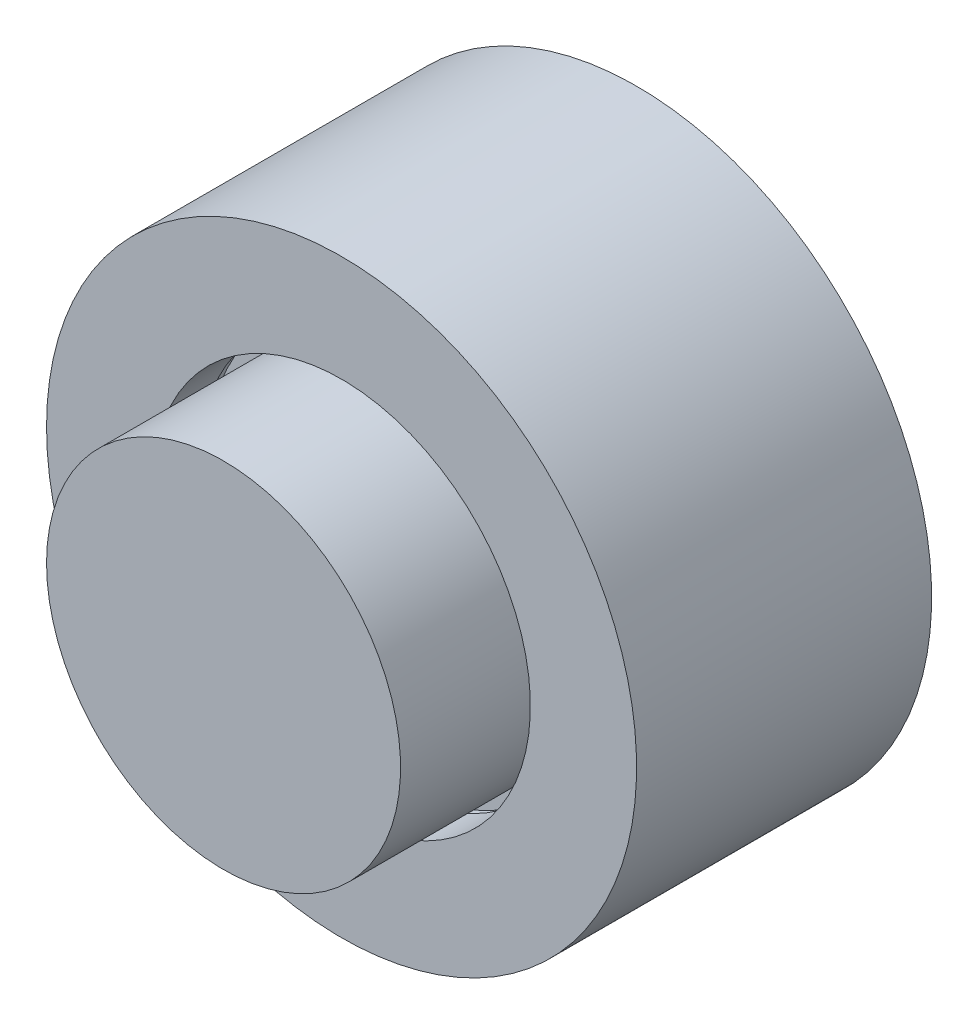
ISO-10303-21;
HEADER;
FILE_DESCRIPTION(('STEP AP214'),'2;1');
FILE_NAME('part.step','',(''),(''),'','','');
FILE_SCHEMA(('AUTOMOTIVE_DESIGN { 1 0 10303 214 1 1 1 1 }'));
ENDSEC;
DATA;
#1=APPLICATION_CONTEXT('core data for automotive mechanical design processes');
#2=APPLICATION_PROTOCOL_DEFINITION('international standard','automotive_design',2000,#1);
#3=PRODUCT_CONTEXT('',#1,'mechanical');
#4=PRODUCT('Part','Part','',(#3));
#5=PRODUCT_RELATED_PRODUCT_CATEGORY('part','',(#4));
#6=PRODUCT_DEFINITION_FORMATION('','',#4);
#7=PRODUCT_DEFINITION_CONTEXT('part definition',#1,'design');
#8=PRODUCT_DEFINITION('design','',#6,#7);
#9=PRODUCT_DEFINITION_SHAPE('','',#8);
#10=(LENGTH_UNIT() NAMED_UNIT(*) SI_UNIT(.MILLI.,.METRE.));
#11=(NAMED_UNIT(*) PLANE_ANGLE_UNIT() SI_UNIT($,.RADIAN.));
#12=(NAMED_UNIT(*) SI_UNIT($,.STERADIAN.) SOLID_ANGLE_UNIT());
#13=UNCERTAINTY_MEASURE_WITH_UNIT(LENGTH_MEASURE(1.E-05),#10,'distance_accuracy_value','');
#14=(GEOMETRIC_REPRESENTATION_CONTEXT(3) GLOBAL_UNCERTAINTY_ASSIGNED_CONTEXT((#13)) GLOBAL_UNIT_ASSIGNED_CONTEXT((#10,
#11,#12)) REPRESENTATION_CONTEXT('',''));
#15=CARTESIAN_POINT('',(0.,0.,0.));
#16=DIRECTION('',(0.,0.,1.));
#17=DIRECTION('',(1.,0.,0.));
#18=AXIS2_PLACEMENT_3D('',#15,#16,#17);
#19=CARTESIAN_POINT('',(0.,0.,-7.));
#20=DIRECTION('',(0.,0.,1.));
#21=DIRECTION('',(1.,0.,0.));
#22=AXIS2_PLACEMENT_3D('',#19,#20,#21);
#23=PLANE('',#22);
#24=CARTESIAN_POINT('',(0.,0.,-7.));
#25=DIRECTION('',(0.,0.,-1.));
#26=DIRECTION('',(-1.,0.,0.));
#27=AXIS2_PLACEMENT_3D('',#24,#25,#26);
#28=CIRCLE('',#27,5.);
#29=CARTESIAN_POINT('',(-5.,0.,-7.));
#30=VERTEX_POINT('',#29);
#31=EDGE_CURVE('E78',#30,#30,#28,.T.);
#32=ORIENTED_EDGE('',*,*,#31,.T.);
#33=EDGE_LOOP('',(#32));
#34=FACE_BOUND('',#33,.T.);
#35=ADVANCED_FACE('F51',(#34),#23,.F.);
#36=CARTESIAN_POINT('',(0.,0.,-6.));
#37=DIRECTION('',(0.,0.,-1.));
#38=DIRECTION('',(-1.,0.,0.));
#39=AXIS2_PLACEMENT_3D('',#36,#37,#38);
#40=PLANE('',#39);
#41=CARTESIAN_POINT('',(0.,0.,-6.));
#42=DIRECTION('',(0.,0.,-1.));
#43=DIRECTION('',(-1.,0.,0.));
#44=AXIS2_PLACEMENT_3D('',#41,#42,#43);
#45=CIRCLE('',#44,3.45);
#46=CARTESIAN_POINT('',(-3.45,0.,-6.));
#47=VERTEX_POINT('',#46);
#48=EDGE_CURVE('E11',#47,#47,#45,.T.);
#49=ORIENTED_EDGE('',*,*,#48,.F.);
#50=EDGE_LOOP('',(#49));
#51=FACE_BOUND('',#50,.T.);
#52=ADVANCED_FACE('F109',(#51),#40,.F.);
#53=CARTESIAN_POINT('',(0.,0.,0.));
#54=DIRECTION('',(0.,0.,-1.));
#55=DIRECTION('',(-1.,0.,0.));
#56=AXIS2_PLACEMENT_3D('',#53,#54,#55);
#57=CYLINDRICAL_SURFACE('',#56,3.45);
#58=CARTESIAN_POINT('',(0.,0.,-2.8));
#59=DIRECTION('',(0.,0.,-1.));
#60=DIRECTION('',(-1.,0.,0.));
#61=AXIS2_PLACEMENT_3D('',#58,#59,#60);
#62=CIRCLE('',#61,3.45);
#63=CARTESIAN_POINT('',(-3.45,0.,-2.8));
#64=VERTEX_POINT('',#63);
#65=EDGE_CURVE('E58',#64,#64,#62,.T.);
#66=ORIENTED_EDGE('',*,*,#65,.F.);
#67=EDGE_LOOP('',(#66));
#68=FACE_BOUND('',#67,.T.);
#69=ORIENTED_EDGE('',*,*,#48,.T.);
#70=EDGE_LOOP('',(#69));
#71=FACE_BOUND('',#70,.T.);
#72=ADVANCED_FACE('F104',(#68,#71),#57,.F.);
#73=CARTESIAN_POINT('',(0.,0.,-2.8));
#74=DIRECTION('',(0.,0.,1.));
#75=DIRECTION('',(1.,0.,0.));
#76=AXIS2_PLACEMENT_3D('',#73,#74,#75);
#77=PLANE('',#76);
#78=CARTESIAN_POINT('',(0.,0.,-2.8));
#79=DIRECTION('',(0.,0.,-1.));
#80=DIRECTION('',(-1.,0.,0.));
#81=AXIS2_PLACEMENT_3D('',#78,#79,#80);
#82=CIRCLE('',#81,3.2);
#83=CARTESIAN_POINT('',(-3.2,0.,-2.8));
#84=VERTEX_POINT('',#83);
#85=EDGE_CURVE('E63',#84,#84,#82,.T.);
#86=ORIENTED_EDGE('',*,*,#85,.F.);
#87=EDGE_LOOP('',(#86));
#88=FACE_BOUND('',#87,.T.);
#89=ORIENTED_EDGE('',*,*,#65,.T.);
#90=EDGE_LOOP('',(#89));
#91=FACE_BOUND('',#90,.T.);
#92=ADVANCED_FACE('F99',(#88,#91),#77,.F.);
#93=CARTESIAN_POINT('',(0.,0.,0.));
#94=DIRECTION('',(0.,0.,-1.));
#95=DIRECTION('',(-1.,0.,0.));
#96=AXIS2_PLACEMENT_3D('',#93,#94,#95);
#97=CYLINDRICAL_SURFACE('',#96,3.2);
#98=CARTESIAN_POINT('',(0.,0.,-2.));
#99=DIRECTION('',(0.,0.,-1.));
#100=DIRECTION('',(-1.,0.,0.));
#101=AXIS2_PLACEMENT_3D('',#98,#99,#100);
#102=CIRCLE('',#101,3.2);
#103=CARTESIAN_POINT('',(-3.2,0.,-2.));
#104=VERTEX_POINT('',#103);
#105=EDGE_CURVE('E68',#104,#104,#102,.T.);
#106=ORIENTED_EDGE('',*,*,#105,.F.);
#107=EDGE_LOOP('',(#106));
#108=FACE_BOUND('',#107,.T.);
#109=ORIENTED_EDGE('',*,*,#85,.T.);
#110=EDGE_LOOP('',(#109));
#111=FACE_BOUND('',#110,.T.);
#112=ADVANCED_FACE('F93',(#108,#111),#97,.F.);
#113=CARTESIAN_POINT('',(0.,0.,-2.));
#114=DIRECTION('',(0.,0.,-1.));
#115=DIRECTION('',(-1.,0.,0.));
#116=AXIS2_PLACEMENT_3D('',#113,#114,#115);
#117=PLANE('',#116);
#118=CARTESIAN_POINT('',(0.,0.,-2.));
#119=DIRECTION('',(0.,0.,-1.));
#120=DIRECTION('',(-1.,0.,0.));
#121=AXIS2_PLACEMENT_3D('',#118,#119,#120);
#122=CIRCLE('',#121,5.);
#123=CARTESIAN_POINT('',(-5.,0.,-2.));
#124=VERTEX_POINT('',#123);
#125=EDGE_CURVE('E74',#124,#124,#122,.T.);
#126=ORIENTED_EDGE('',*,*,#125,.F.);
#127=EDGE_LOOP('',(#126));
#128=FACE_BOUND('',#127,.T.);
#129=ORIENTED_EDGE('',*,*,#105,.T.);
#130=EDGE_LOOP('',(#129));
#131=FACE_BOUND('',#130,.T.);
#132=ADVANCED_FACE('F87',(#128,#131),#117,.F.);
#133=CARTESIAN_POINT('',(0.,0.,0.));
#134=DIRECTION('',(0.,0.,-1.));
#135=DIRECTION('',(-1.,0.,0.));
#136=AXIS2_PLACEMENT_3D('',#133,#134,#135);
#137=CYLINDRICAL_SURFACE('',#136,5.);
#138=ORIENTED_EDGE('',*,*,#31,.F.);
#139=EDGE_LOOP('',(#138));
#140=FACE_BOUND('',#139,.T.);
#141=ORIENTED_EDGE('',*,*,#125,.T.);
#142=EDGE_LOOP('',(#141));
#143=FACE_BOUND('',#142,.T.);
#144=ADVANCED_FACE('F84',(#140,#143),#137,.T.);
#145=CLOSED_SHELL('',(#35,#52,#72,#92,#112,#132,#144));
#146=MANIFOLD_SOLID_BREP('B2',#145);
#147=CARTESIAN_POINT('',(0.,0.,-1.));
#148=DIRECTION('',(0.,0.,1.));
#149=DIRECTION('',(1.,0.,0.));
#150=AXIS2_PLACEMENT_3D('',#147,#148,#149);
#151=PLANE('',#150);
#152=CARTESIAN_POINT('',(0.,0.,-1.));
#153=DIRECTION('',(0.,0.,-1.));
#154=DIRECTION('',(-1.,0.,0.));
#155=AXIS2_PLACEMENT_3D('',#152,#153,#154);
#156=CIRCLE('',#155,1.5);
#157=CARTESIAN_POINT('',(-1.5,0.,-1.));
#158=VERTEX_POINT('',#157);
#159=EDGE_CURVE('E194',#158,#158,#156,.T.);
#160=ORIENTED_EDGE('',*,*,#159,.T.);
#161=EDGE_LOOP('',(#160));
#162=FACE_BOUND('',#161,.T.);
#163=ADVANCED_FACE('F172',(#162),#151,.F.);
#164=CARTESIAN_POINT('',(0.,0.,0.));
#165=DIRECTION('',(0.,0.,-1.));
#166=DIRECTION('',(-1.,0.,0.));
#167=AXIS2_PLACEMENT_3D('',#164,#165,#166);
#168=PLANE('',#167);
#169=CARTESIAN_POINT('',(0.,0.,0.));
#170=DIRECTION('',(0.,0.,-1.));
#171=DIRECTION('',(-1.,0.,0.));
#172=AXIS2_PLACEMENT_3D('',#169,#170,#171);
#173=CIRCLE('',#172,3.);
#174=CARTESIAN_POINT('',(-3.,0.,0.));
#175=VERTEX_POINT('',#174);
#176=EDGE_CURVE('E50',#175,#175,#173,.T.);
#177=ORIENTED_EDGE('',*,*,#176,.F.);
#178=EDGE_LOOP('',(#177));
#179=FACE_BOUND('',#178,.T.);
#180=ADVANCED_FACE('F224',(#179),#168,.F.);
#181=CARTESIAN_POINT('',(0.,0.,0.));
#182=DIRECTION('',(0.,0.,-1.));
#183=DIRECTION('',(-1.,0.,0.));
#184=AXIS2_PLACEMENT_3D('',#181,#182,#183);
#185=CYLINDRICAL_SURFACE('',#184,3.);
#186=CARTESIAN_POINT('',(0.,0.,-3.));
#187=DIRECTION('',(0.,0.,-1.));
#188=DIRECTION('',(-1.,0.,0.));
#189=AXIS2_PLACEMENT_3D('',#186,#187,#188);
#190=CIRCLE('',#189,3.);
#191=CARTESIAN_POINT('',(-3.,0.,-3.));
#192=VERTEX_POINT('',#191);
#193=EDGE_CURVE('E178',#192,#192,#190,.T.);
#194=ORIENTED_EDGE('',*,*,#193,.F.);
#195=EDGE_LOOP('',(#194));
#196=FACE_BOUND('',#195,.T.);
#197=ORIENTED_EDGE('',*,*,#176,.T.);
#198=EDGE_LOOP('',(#197));
#199=FACE_BOUND('',#198,.T.);
#200=ADVANCED_FACE('F219',(#196,#199),#185,.T.);
#201=CARTESIAN_POINT('',(0.,0.,-3.));
#202=DIRECTION('',(0.,0.,-1.));
#203=DIRECTION('',(-1.,0.,0.));
#204=AXIS2_PLACEMENT_3D('',#201,#202,#203);
#205=PLANE('',#204);
#206=CARTESIAN_POINT('',(0.,0.,-3.));
#207=DIRECTION('',(0.,0.,-1.));
#208=DIRECTION('',(-1.,0.,0.));
#209=AXIS2_PLACEMENT_3D('',#206,#207,#208);
#210=CIRCLE('',#209,3.25);
#211=CARTESIAN_POINT('',(-3.25,0.,-3.));
#212=VERTEX_POINT('',#211);
#213=EDGE_CURVE('E182',#212,#212,#210,.T.);
#214=ORIENTED_EDGE('',*,*,#213,.F.);
#215=EDGE_LOOP('',(#214));
#216=FACE_BOUND('',#215,.T.);
#217=ORIENTED_EDGE('',*,*,#193,.T.);
#218=EDGE_LOOP('',(#217));
#219=FACE_BOUND('',#218,.T.);
#220=ADVANCED_FACE('F214',(#216,#219),#205,.F.);
#221=CARTESIAN_POINT('',(0.,0.,0.));
#222=DIRECTION('',(0.,0.,-1.));
#223=DIRECTION('',(-1.,0.,0.));
#224=AXIS2_PLACEMENT_3D('',#221,#222,#223);
#225=CYLINDRICAL_SURFACE('',#224,3.25);
#226=CARTESIAN_POINT('',(0.,0.,-4.));
#227=DIRECTION('',(0.,0.,-1.));
#228=DIRECTION('',(-1.,0.,0.));
#229=AXIS2_PLACEMENT_3D('',#226,#227,#228);
#230=CIRCLE('',#229,3.25);
#231=CARTESIAN_POINT('',(-3.25,0.,-4.));
#232=VERTEX_POINT('',#231);
#233=EDGE_CURVE('E186',#232,#232,#230,.T.);
#234=ORIENTED_EDGE('',*,*,#233,.F.);
#235=EDGE_LOOP('',(#234));
#236=FACE_BOUND('',#235,.T.);
#237=ORIENTED_EDGE('',*,*,#213,.T.);
#238=EDGE_LOOP('',(#237));
#239=FACE_BOUND('',#238,.T.);
#240=ADVANCED_FACE('F208',(#236,#239),#225,.T.);
#241=CARTESIAN_POINT('',(0.,0.,-4.));
#242=DIRECTION('',(0.,0.,1.));
#243=DIRECTION('',(1.,0.,0.));
#244=AXIS2_PLACEMENT_3D('',#241,#242,#243);
#245=PLANE('',#244);
#246=CARTESIAN_POINT('',(0.,0.,-4.));
#247=DIRECTION('',(0.,0.,-1.));
#248=DIRECTION('',(-1.,0.,0.));
#249=AXIS2_PLACEMENT_3D('',#246,#247,#248);
#250=CIRCLE('',#249,1.5);
#251=CARTESIAN_POINT('',(-1.5,0.,-4.));
#252=VERTEX_POINT('',#251);
#253=EDGE_CURVE('E191',#252,#252,#250,.T.);
#254=ORIENTED_EDGE('',*,*,#253,.F.);
#255=EDGE_LOOP('',(#254));
#256=FACE_BOUND('',#255,.T.);
#257=ORIENTED_EDGE('',*,*,#233,.T.);
#258=EDGE_LOOP('',(#257));
#259=FACE_BOUND('',#258,.T.);
#260=ADVANCED_FACE('F202',(#256,#259),#245,.F.);
#261=CARTESIAN_POINT('',(0.,0.,0.));
#262=DIRECTION('',(0.,0.,-1.));
#263=DIRECTION('',(-1.,0.,0.));
#264=AXIS2_PLACEMENT_3D('',#261,#262,#263);
#265=CYLINDRICAL_SURFACE('',#264,1.5);
#266=ORIENTED_EDGE('',*,*,#159,.F.);
#267=EDGE_LOOP('',(#266));
#268=FACE_BOUND('',#267,.T.);
#269=ORIENTED_EDGE('',*,*,#253,.T.);
#270=EDGE_LOOP('',(#269));
#271=FACE_BOUND('',#270,.T.);
#272=ADVANCED_FACE('F199',(#268,#271),#265,.F.);
#273=CLOSED_SHELL('',(#163,#180,#200,#220,#240,#260,#272));
#274=MANIFOLD_SOLID_BREP('B6',#273);
#275=ADVANCED_BREP_SHAPE_REPRESENTATION('',(#18,#146,#274),#14);
#276=SHAPE_DEFINITION_REPRESENTATION(#9,#275);
ENDSEC;
END-ISO-10303-21;
